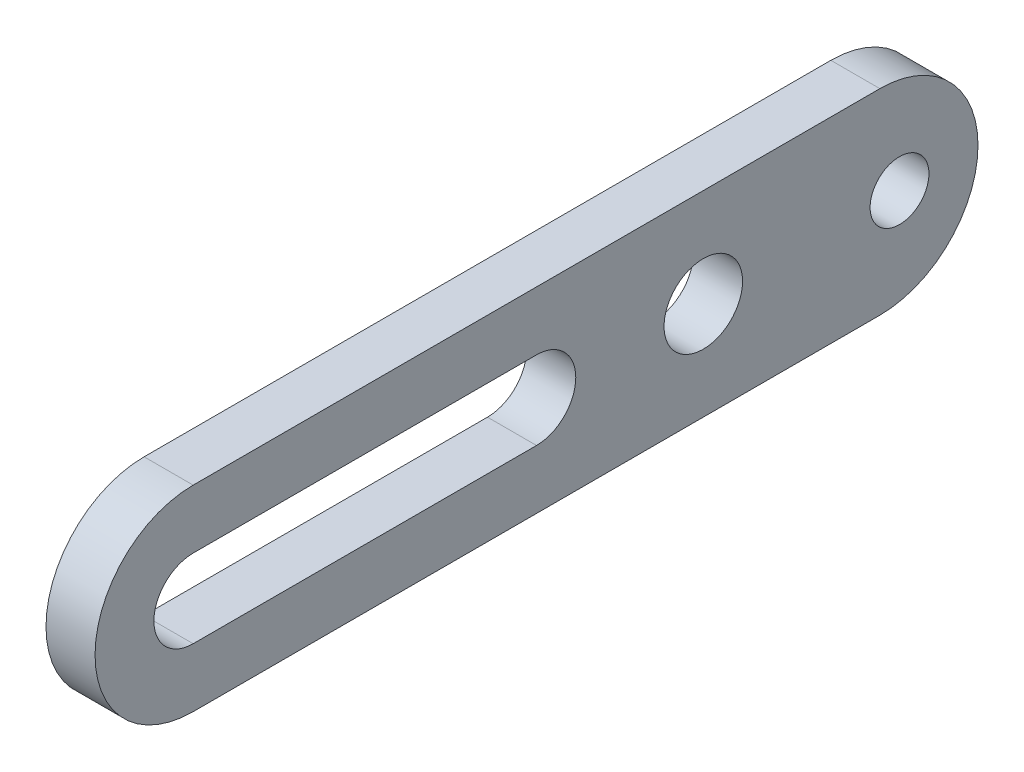
ISO-10303-21;
HEADER;
FILE_DESCRIPTION(('STEP AP214'),'2;1');
FILE_NAME('part.step','',(''),(''),'','','');
FILE_SCHEMA(('AUTOMOTIVE_DESIGN { 1 0 10303 214 1 1 1 1 }'));
ENDSEC;
DATA;
#1=APPLICATION_CONTEXT('core data for automotive mechanical design processes');
#2=APPLICATION_PROTOCOL_DEFINITION('international standard','automotive_design',2000,#1);
#3=PRODUCT_CONTEXT('',#1,'mechanical');
#4=PRODUCT('Part','Part','',(#3));
#5=PRODUCT_RELATED_PRODUCT_CATEGORY('part','',(#4));
#6=PRODUCT_DEFINITION_FORMATION('','',#4);
#7=PRODUCT_DEFINITION_CONTEXT('part definition',#1,'design');
#8=PRODUCT_DEFINITION('design','',#6,#7);
#9=PRODUCT_DEFINITION_SHAPE('','',#8);
#10=(LENGTH_UNIT() NAMED_UNIT(*) SI_UNIT(.MILLI.,.METRE.));
#11=(NAMED_UNIT(*) PLANE_ANGLE_UNIT() SI_UNIT($,.RADIAN.));
#12=(NAMED_UNIT(*) SI_UNIT($,.STERADIAN.) SOLID_ANGLE_UNIT());
#13=UNCERTAINTY_MEASURE_WITH_UNIT(LENGTH_MEASURE(1.E-05),#10,'distance_accuracy_value','');
#14=(GEOMETRIC_REPRESENTATION_CONTEXT(3) GLOBAL_UNCERTAINTY_ASSIGNED_CONTEXT((#13)) GLOBAL_UNIT_ASSIGNED_CONTEXT((#10,
#11,#12)) REPRESENTATION_CONTEXT('',''));
#15=CARTESIAN_POINT('',(0.,0.,0.));
#16=DIRECTION('',(0.,0.,1.));
#17=DIRECTION('',(1.,0.,0.));
#18=AXIS2_PLACEMENT_3D('',#15,#16,#17);
#19=CARTESIAN_POINT('',(5.,0.,35.));
#20=DIRECTION('',(-1.,0.,0.));
#21=DIRECTION('',(0.,0.,1.));
#22=AXIS2_PLACEMENT_3D('',#19,#20,#21);
#23=CYLINDRICAL_SURFACE('',#22,10.);
#24=CARTESIAN_POINT('',(0.,0.,35.));
#25=DIRECTION('',(1.,0.,0.));
#26=DIRECTION('',(0.,0.,-1.));
#27=AXIS2_PLACEMENT_3D('',#24,#25,#26);
#28=CIRCLE('',#27,10.);
#29=CARTESIAN_POINT('',(0.,10.,35.));
#30=VERTEX_POINT('',#29);
#31=CARTESIAN_POINT('',(0.,-10.,35.));
#32=VERTEX_POINT('',#31);
#33=EDGE_CURVE('E144',#30,#32,#28,.T.);
#34=ORIENTED_EDGE('',*,*,#33,.T.);
#35=DIRECTION('',(-1.,0.,0.));
#36=VECTOR('',#35,1.);
#37=CARTESIAN_POINT('',(5.,-10.,35.));
#38=LINE('',#37,#36);
#39=CARTESIAN_POINT('',(5.,-10.,35.));
#40=VERTEX_POINT('',#39);
#41=EDGE_CURVE('E11',#40,#32,#38,.T.);
#42=ORIENTED_EDGE('',*,*,#41,.F.);
#43=CARTESIAN_POINT('',(5.,0.,35.));
#44=DIRECTION('',(1.,0.,0.));
#45=DIRECTION('',(0.,0.,-1.));
#46=AXIS2_PLACEMENT_3D('',#43,#44,#45);
#47=CIRCLE('',#46,10.);
#48=CARTESIAN_POINT('',(5.,10.,35.));
#49=VERTEX_POINT('',#48);
#50=EDGE_CURVE('E147',#49,#40,#47,.T.);
#51=ORIENTED_EDGE('',*,*,#50,.F.);
#52=DIRECTION('',(-1.,0.,0.));
#53=VECTOR('',#52,1.);
#54=CARTESIAN_POINT('',(5.,10.,35.));
#55=LINE('',#54,#53);
#56=EDGE_CURVE('E158',#49,#30,#55,.T.);
#57=ORIENTED_EDGE('',*,*,#56,.T.);
#58=EDGE_LOOP('',(#34,#42,#51,#57));
#59=FACE_BOUND('',#58,.T.);
#60=ADVANCED_FACE('F34',(#59),#23,.T.);
#61=CARTESIAN_POINT('',(5.,-10.,35.));
#62=DIRECTION('',(0.,1.,0.));
#63=DIRECTION('',(0.,0.,1.));
#64=AXIS2_PLACEMENT_3D('',#61,#62,#63);
#65=PLANE('',#64);
#66=DIRECTION('',(0.,0.,-1.));
#67=VECTOR('',#66,1.);
#68=CARTESIAN_POINT('',(0.,-10.,35.));
#69=LINE('',#68,#67);
#70=CARTESIAN_POINT('',(0.,-9.99999999999999,-35.));
#71=VERTEX_POINT('',#70);
#72=EDGE_CURVE('E161',#32,#71,#69,.T.);
#73=ORIENTED_EDGE('',*,*,#72,.T.);
#74=DIRECTION('',(-1.,0.,0.));
#75=VECTOR('',#74,1.);
#76=CARTESIAN_POINT('',(5.,-9.99999999999999,-35.));
#77=LINE('',#76,#75);
#78=CARTESIAN_POINT('',(5.,-9.99999999999999,-35.));
#79=VERTEX_POINT('',#78);
#80=EDGE_CURVE('E41',#79,#71,#77,.T.);
#81=ORIENTED_EDGE('',*,*,#80,.F.);
#82=DIRECTION('',(0.,0.,-1.));
#83=VECTOR('',#82,1.);
#84=CARTESIAN_POINT('',(5.,-10.,35.));
#85=LINE('',#84,#83);
#86=EDGE_CURVE('E150',#40,#79,#85,.T.);
#87=ORIENTED_EDGE('',*,*,#86,.F.);
#88=ORIENTED_EDGE('',*,*,#41,.T.);
#89=EDGE_LOOP('',(#73,#81,#87,#88));
#90=FACE_BOUND('',#89,.T.);
#91=ADVANCED_FACE('F188',(#90),#65,.F.);
#92=CARTESIAN_POINT('',(5.,0.,-35.));
#93=DIRECTION('',(-1.,0.,0.));
#94=DIRECTION('',(0.,0.,1.));
#95=AXIS2_PLACEMENT_3D('',#92,#93,#94);
#96=CYLINDRICAL_SURFACE('',#95,10.);
#97=CARTESIAN_POINT('',(0.,0.,-35.));
#98=DIRECTION('',(1.,0.,0.));
#99=DIRECTION('',(0.,0.,-1.));
#100=AXIS2_PLACEMENT_3D('',#97,#98,#99);
#101=CIRCLE('',#100,10.);
#102=CARTESIAN_POINT('',(0.,10.,-35.));
#103=VERTEX_POINT('',#102);
#104=EDGE_CURVE('E163',#71,#103,#101,.T.);
#105=ORIENTED_EDGE('',*,*,#104,.T.);
#106=DIRECTION('',(-1.,0.,0.));
#107=VECTOR('',#106,1.);
#108=CARTESIAN_POINT('',(5.,10.,-35.));
#109=LINE('',#108,#107);
#110=CARTESIAN_POINT('',(5.,10.,-35.));
#111=VERTEX_POINT('',#110);
#112=EDGE_CURVE('E169',#111,#103,#109,.T.);
#113=ORIENTED_EDGE('',*,*,#112,.F.);
#114=CARTESIAN_POINT('',(5.,0.,-35.));
#115=DIRECTION('',(1.,0.,0.));
#116=DIRECTION('',(0.,0.,-1.));
#117=AXIS2_PLACEMENT_3D('',#114,#115,#116);
#118=CIRCLE('',#117,10.);
#119=EDGE_CURVE('E153',#79,#111,#118,.T.);
#120=ORIENTED_EDGE('',*,*,#119,.F.);
#121=ORIENTED_EDGE('',*,*,#80,.T.);
#122=EDGE_LOOP('',(#105,#113,#120,#121));
#123=FACE_BOUND('',#122,.T.);
#124=ADVANCED_FACE('F175',(#123),#96,.T.);
#125=CARTESIAN_POINT('',(5.,10.,35.));
#126=DIRECTION('',(0.,1.,0.));
#127=DIRECTION('',(0.,0.,1.));
#128=AXIS2_PLACEMENT_3D('',#125,#126,#127);
#129=PLANE('',#128);
#130=DIRECTION('',(0.,0.,-1.));
#131=VECTOR('',#130,1.);
#132=CARTESIAN_POINT('',(0.,10.,35.));
#133=LINE('',#132,#131);
#134=EDGE_CURVE('E151',#30,#103,#133,.T.);
#135=ORIENTED_EDGE('',*,*,#134,.F.);
#136=ORIENTED_EDGE('',*,*,#56,.F.);
#137=DIRECTION('',(0.,0.,-1.));
#138=VECTOR('',#137,1.);
#139=CARTESIAN_POINT('',(5.,10.,35.));
#140=LINE('',#139,#138);
#141=EDGE_CURVE('E155',#49,#111,#140,.T.);
#142=ORIENTED_EDGE('',*,*,#141,.T.);
#143=ORIENTED_EDGE('',*,*,#112,.T.);
#144=EDGE_LOOP('',(#135,#136,#142,#143));
#145=FACE_BOUND('',#144,.T.);
#146=ADVANCED_FACE('F182',(#145),#129,.T.);
#147=CARTESIAN_POINT('',(5.,0.,35.));
#148=DIRECTION('',(1.,0.,0.));
#149=DIRECTION('',(0.,0.,-1.));
#150=AXIS2_PLACEMENT_3D('',#147,#148,#149);
#151=PLANE('',#150);
#152=CARTESIAN_POINT('',(5.,0.,35.));
#153=DIRECTION('',(1.,0.,0.));
#154=DIRECTION('',(0.,0.,-1.));
#155=AXIS2_PLACEMENT_3D('',#152,#153,#154);
#156=CIRCLE('',#155,4.);
#157=CARTESIAN_POINT('',(5.,4.,35.));
#158=VERTEX_POINT('',#157);
#159=CARTESIAN_POINT('',(5.,-4.,35.));
#160=VERTEX_POINT('',#159);
#161=EDGE_CURVE('E48',#158,#160,#156,.T.);
#162=ORIENTED_EDGE('',*,*,#161,.F.);
#163=DIRECTION('',(0.,0.,1.));
#164=VECTOR('',#163,1.);
#165=CARTESIAN_POINT('',(5.,4.,35.));
#166=LINE('',#165,#164);
#167=CARTESIAN_POINT('',(5.,4.,0.));
#168=VERTEX_POINT('',#167);
#169=EDGE_CURVE('E116',#168,#158,#166,.T.);
#170=ORIENTED_EDGE('',*,*,#169,.F.);
#171=CARTESIAN_POINT('',(5.,0.,0.));
#172=DIRECTION('',(1.,0.,0.));
#173=DIRECTION('',(0.,0.,-1.));
#174=AXIS2_PLACEMENT_3D('',#171,#172,#173);
#175=CIRCLE('',#174,4.);
#176=CARTESIAN_POINT('',(5.,-4.,0.));
#177=VERTEX_POINT('',#176);
#178=EDGE_CURVE('E119',#177,#168,#175,.T.);
#179=ORIENTED_EDGE('',*,*,#178,.F.);
#180=DIRECTION('',(0.,0.,-1.));
#181=VECTOR('',#180,1.);
#182=CARTESIAN_POINT('',(5.,-4.,35.));
#183=LINE('',#182,#181);
#184=EDGE_CURVE('E125',#160,#177,#183,.T.);
#185=ORIENTED_EDGE('',*,*,#184,.F.);
#186=EDGE_LOOP('',(#162,#170,#179,#185));
#187=FACE_BOUND('',#186,.T.);
#188=CARTESIAN_POINT('',(5.,0.,-37.));
#189=DIRECTION('',(1.,0.,0.));
#190=DIRECTION('',(0.,0.,-1.));
#191=AXIS2_PLACEMENT_3D('',#188,#189,#190);
#192=CIRCLE('',#191,3.);
#193=CARTESIAN_POINT('',(5.,0.,-40.));
#194=VERTEX_POINT('',#193);
#195=EDGE_CURVE('E131',#194,#194,#192,.T.);
#196=ORIENTED_EDGE('',*,*,#195,.F.);
#197=EDGE_LOOP('',(#196));
#198=FACE_BOUND('',#197,.T.);
#199=CARTESIAN_POINT('',(5.,0.,-17.));
#200=DIRECTION('',(1.,0.,0.));
#201=DIRECTION('',(0.,0.,-1.));
#202=AXIS2_PLACEMENT_3D('',#199,#200,#201);
#203=CIRCLE('',#202,4.);
#204=CARTESIAN_POINT('',(5.,0.,-21.));
#205=VERTEX_POINT('',#204);
#206=EDGE_CURVE('E138',#205,#205,#203,.T.);
#207=ORIENTED_EDGE('',*,*,#206,.F.);
#208=EDGE_LOOP('',(#207));
#209=FACE_BOUND('',#208,.T.);
#210=ORIENTED_EDGE('',*,*,#50,.T.);
#211=ORIENTED_EDGE('',*,*,#86,.T.);
#212=ORIENTED_EDGE('',*,*,#119,.T.);
#213=ORIENTED_EDGE('',*,*,#141,.F.);
#214=EDGE_LOOP('',(#210,#211,#212,#213));
#215=FACE_BOUND('',#214,.T.);
#216=ADVANCED_FACE('F186',(#187,#198,#209,#215),#151,.T.);
#217=CARTESIAN_POINT('',(0.,0.,35.));
#218=DIRECTION('',(1.,0.,0.));
#219=DIRECTION('',(0.,0.,-1.));
#220=AXIS2_PLACEMENT_3D('',#217,#218,#219);
#221=PLANE('',#220);
#222=DIRECTION('',(0.,0.,1.));
#223=VECTOR('',#222,1.);
#224=CARTESIAN_POINT('',(0.,4.,35.));
#225=LINE('',#224,#223);
#226=CARTESIAN_POINT('',(0.,4.,0.));
#227=VERTEX_POINT('',#226);
#228=CARTESIAN_POINT('',(0.,4.,35.));
#229=VERTEX_POINT('',#228);
#230=EDGE_CURVE('E106',#227,#229,#225,.T.);
#231=ORIENTED_EDGE('',*,*,#230,.T.);
#232=CARTESIAN_POINT('',(0.,0.,35.));
#233=DIRECTION('',(1.,0.,0.));
#234=DIRECTION('',(0.,0.,-1.));
#235=AXIS2_PLACEMENT_3D('',#232,#233,#234);
#236=CIRCLE('',#235,4.);
#237=CARTESIAN_POINT('',(0.,-4.,35.));
#238=VERTEX_POINT('',#237);
#239=EDGE_CURVE('E100',#229,#238,#236,.T.);
#240=ORIENTED_EDGE('',*,*,#239,.T.);
#241=DIRECTION('',(0.,0.,-1.));
#242=VECTOR('',#241,1.);
#243=CARTESIAN_POINT('',(0.,-4.,35.));
#244=LINE('',#243,#242);
#245=CARTESIAN_POINT('',(0.,-4.,0.));
#246=VERTEX_POINT('',#245);
#247=EDGE_CURVE('E109',#238,#246,#244,.T.);
#248=ORIENTED_EDGE('',*,*,#247,.T.);
#249=CARTESIAN_POINT('',(0.,0.,0.));
#250=DIRECTION('',(1.,0.,0.));
#251=DIRECTION('',(0.,0.,-1.));
#252=AXIS2_PLACEMENT_3D('',#249,#250,#251);
#253=CIRCLE('',#252,4.);
#254=EDGE_CURVE('E56',#246,#227,#253,.T.);
#255=ORIENTED_EDGE('',*,*,#254,.T.);
#256=EDGE_LOOP('',(#231,#240,#248,#255));
#257=FACE_BOUND('',#256,.T.);
#258=CARTESIAN_POINT('',(0.,0.,-37.));
#259=DIRECTION('',(1.,0.,0.));
#260=DIRECTION('',(0.,0.,-1.));
#261=AXIS2_PLACEMENT_3D('',#258,#259,#260);
#262=CIRCLE('',#261,3.);
#263=CARTESIAN_POINT('',(0.,0.,-40.));
#264=VERTEX_POINT('',#263);
#265=EDGE_CURVE('E135',#264,#264,#262,.T.);
#266=ORIENTED_EDGE('',*,*,#265,.T.);
#267=EDGE_LOOP('',(#266));
#268=FACE_BOUND('',#267,.T.);
#269=CARTESIAN_POINT('',(0.,0.,-17.));
#270=DIRECTION('',(1.,0.,0.));
#271=DIRECTION('',(0.,0.,-1.));
#272=AXIS2_PLACEMENT_3D('',#269,#270,#271);
#273=CIRCLE('',#272,4.);
#274=CARTESIAN_POINT('',(0.,0.,-21.));
#275=VERTEX_POINT('',#274);
#276=EDGE_CURVE('E141',#275,#275,#273,.T.);
#277=ORIENTED_EDGE('',*,*,#276,.T.);
#278=EDGE_LOOP('',(#277));
#279=FACE_BOUND('',#278,.T.);
#280=ORIENTED_EDGE('',*,*,#33,.F.);
#281=ORIENTED_EDGE('',*,*,#134,.T.);
#282=ORIENTED_EDGE('',*,*,#104,.F.);
#283=ORIENTED_EDGE('',*,*,#72,.F.);
#284=EDGE_LOOP('',(#280,#281,#282,#283));
#285=FACE_BOUND('',#284,.T.);
#286=ADVANCED_FACE('F113',(#257,#268,#279,#285),#221,.F.);
#287=CARTESIAN_POINT('',(0.,0.,-17.));
#288=DIRECTION('',(1.,0.,0.));
#289=DIRECTION('',(0.,0.,-1.));
#290=AXIS2_PLACEMENT_3D('',#287,#288,#289);
#291=CYLINDRICAL_SURFACE('',#290,4.);
#292=ORIENTED_EDGE('',*,*,#276,.F.);
#293=EDGE_LOOP('',(#292));
#294=FACE_BOUND('',#293,.T.);
#295=ORIENTED_EDGE('',*,*,#206,.T.);
#296=EDGE_LOOP('',(#295));
#297=FACE_BOUND('',#296,.T.);
#298=ADVANCED_FACE('F203',(#294,#297),#291,.F.);
#299=CARTESIAN_POINT('',(0.,0.,-37.));
#300=DIRECTION('',(1.,0.,0.));
#301=DIRECTION('',(0.,0.,-1.));
#302=AXIS2_PLACEMENT_3D('',#299,#300,#301);
#303=CYLINDRICAL_SURFACE('',#302,3.);
#304=ORIENTED_EDGE('',*,*,#265,.F.);
#305=EDGE_LOOP('',(#304));
#306=FACE_BOUND('',#305,.T.);
#307=ORIENTED_EDGE('',*,*,#195,.T.);
#308=EDGE_LOOP('',(#307));
#309=FACE_BOUND('',#308,.T.);
#310=ADVANCED_FACE('F209',(#306,#309),#303,.F.);
#311=CARTESIAN_POINT('',(0.,0.,35.));
#312=DIRECTION('',(1.,0.,0.));
#313=DIRECTION('',(0.,0.,-1.));
#314=AXIS2_PLACEMENT_3D('',#311,#312,#313);
#315=CYLINDRICAL_SURFACE('',#314,4.);
#316=ORIENTED_EDGE('',*,*,#161,.T.);
#317=DIRECTION('',(1.,0.,0.));
#318=VECTOR('',#317,1.);
#319=CARTESIAN_POINT('',(0.,-4.,35.));
#320=LINE('',#319,#318);
#321=EDGE_CURVE('E96',#238,#160,#320,.T.);
#322=ORIENTED_EDGE('',*,*,#321,.F.);
#323=ORIENTED_EDGE('',*,*,#239,.F.);
#324=DIRECTION('',(1.,0.,0.));
#325=VECTOR('',#324,1.);
#326=CARTESIAN_POINT('',(0.,4.,35.));
#327=LINE('',#326,#325);
#328=EDGE_CURVE('E129',#229,#158,#327,.T.);
#329=ORIENTED_EDGE('',*,*,#328,.T.);
#330=EDGE_LOOP('',(#316,#322,#323,#329));
#331=FACE_BOUND('',#330,.T.);
#332=ADVANCED_FACE('F98',(#331),#315,.F.);
#333=CARTESIAN_POINT('',(0.,4.,35.));
#334=DIRECTION('',(0.,1.,0.));
#335=DIRECTION('',(0.,0.,1.));
#336=AXIS2_PLACEMENT_3D('',#333,#334,#335);
#337=PLANE('',#336);
#338=ORIENTED_EDGE('',*,*,#169,.T.);
#339=ORIENTED_EDGE('',*,*,#328,.F.);
#340=ORIENTED_EDGE('',*,*,#230,.F.);
#341=DIRECTION('',(1.,0.,0.));
#342=VECTOR('',#341,1.);
#343=CARTESIAN_POINT('',(0.,4.,0.));
#344=LINE('',#343,#342);
#345=EDGE_CURVE('E132',#227,#168,#344,.T.);
#346=ORIENTED_EDGE('',*,*,#345,.T.);
#347=EDGE_LOOP('',(#338,#339,#340,#346));
#348=FACE_BOUND('',#347,.T.);
#349=ADVANCED_FACE('F216',(#348),#337,.F.);
#350=CARTESIAN_POINT('',(0.,0.,0.));
#351=DIRECTION('',(1.,0.,0.));
#352=DIRECTION('',(0.,0.,-1.));
#353=AXIS2_PLACEMENT_3D('',#350,#351,#352);
#354=CYLINDRICAL_SURFACE('',#353,4.);
#355=ORIENTED_EDGE('',*,*,#178,.T.);
#356=ORIENTED_EDGE('',*,*,#345,.F.);
#357=ORIENTED_EDGE('',*,*,#254,.F.);
#358=DIRECTION('',(1.,0.,0.));
#359=VECTOR('',#358,1.);
#360=CARTESIAN_POINT('',(0.,-4.,0.));
#361=LINE('',#360,#359);
#362=EDGE_CURVE('E105',#246,#177,#361,.T.);
#363=ORIENTED_EDGE('',*,*,#362,.T.);
#364=EDGE_LOOP('',(#355,#356,#357,#363));
#365=FACE_BOUND('',#364,.T.);
#366=ADVANCED_FACE('F219',(#365),#354,.F.);
#367=CARTESIAN_POINT('',(0.,-4.,35.));
#368=DIRECTION('',(0.,-1.,0.));
#369=DIRECTION('',(0.,0.,-1.));
#370=AXIS2_PLACEMENT_3D('',#367,#368,#369);
#371=PLANE('',#370);
#372=ORIENTED_EDGE('',*,*,#184,.T.);
#373=ORIENTED_EDGE('',*,*,#362,.F.);
#374=ORIENTED_EDGE('',*,*,#247,.F.);
#375=ORIENTED_EDGE('',*,*,#321,.T.);
#376=EDGE_LOOP('',(#372,#373,#374,#375));
#377=FACE_BOUND('',#376,.T.);
#378=ADVANCED_FACE('F110',(#377),#371,.F.);
#379=CLOSED_SHELL('',(#60,#91,#124,#146,#216,#286,#298,#310,#332,#349,#366,#378));
#380=MANIFOLD_SOLID_BREP('B2',#379);
#381=ADVANCED_BREP_SHAPE_REPRESENTATION('',(#18,#380),#14);
#382=SHAPE_DEFINITION_REPRESENTATION(#9,#381);
ENDSEC;
END-ISO-10303-21;
